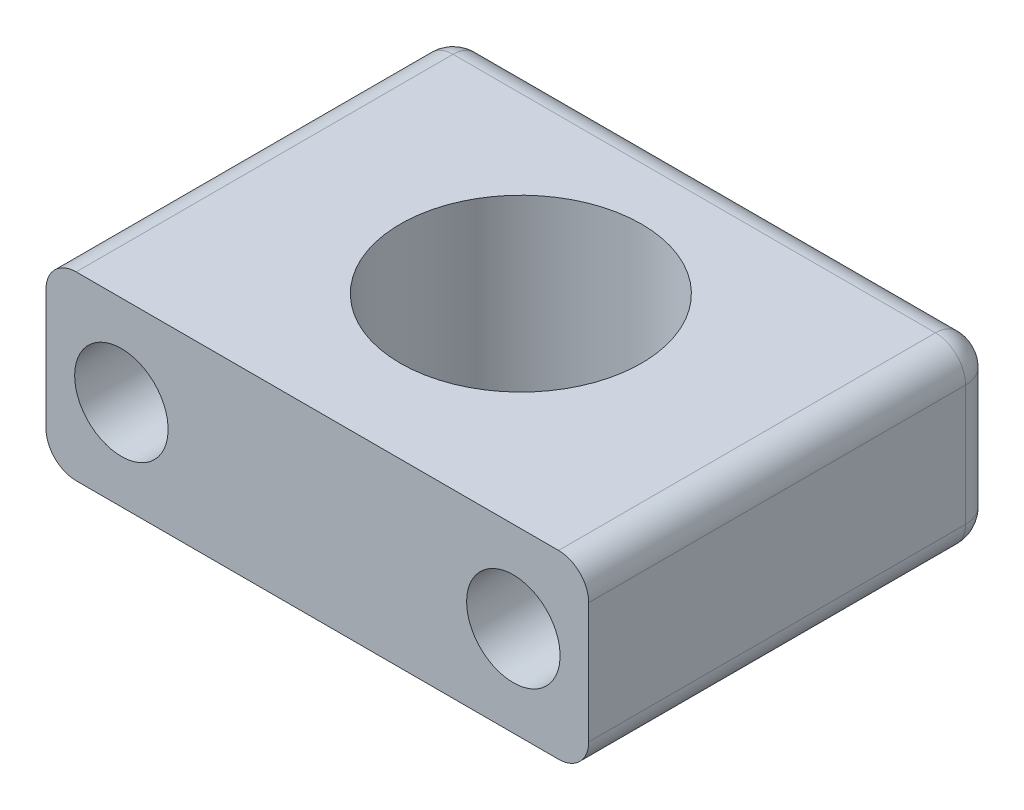
ISO-10303-21;
HEADER;
FILE_DESCRIPTION(('STEP AP214'),'2;1');
FILE_NAME('part.step','',(''),(''),'','','');
FILE_SCHEMA(('AUTOMOTIVE_DESIGN { 1 0 10303 214 1 1 1 1 }'));
ENDSEC;
DATA;
#1=APPLICATION_CONTEXT('core data for automotive mechanical design processes');
#2=APPLICATION_PROTOCOL_DEFINITION('international standard','automotive_design',2000,#1);
#3=PRODUCT_CONTEXT('',#1,'mechanical');
#4=PRODUCT('Part','Part','',(#3));
#5=PRODUCT_RELATED_PRODUCT_CATEGORY('part','',(#4));
#6=PRODUCT_DEFINITION_FORMATION('','',#4);
#7=PRODUCT_DEFINITION_CONTEXT('part definition',#1,'design');
#8=PRODUCT_DEFINITION('design','',#6,#7);
#9=PRODUCT_DEFINITION_SHAPE('','',#8);
#10=(LENGTH_UNIT() NAMED_UNIT(*) SI_UNIT(.MILLI.,.METRE.));
#11=(NAMED_UNIT(*) PLANE_ANGLE_UNIT() SI_UNIT($,.RADIAN.));
#12=(NAMED_UNIT(*) SI_UNIT($,.STERADIAN.) SOLID_ANGLE_UNIT());
#13=UNCERTAINTY_MEASURE_WITH_UNIT(LENGTH_MEASURE(1.E-05),#10,'distance_accuracy_value','');
#14=(GEOMETRIC_REPRESENTATION_CONTEXT(3) GLOBAL_UNCERTAINTY_ASSIGNED_CONTEXT((#13)) GLOBAL_UNIT_ASSIGNED_CONTEXT((#10,
#11,#12)) REPRESENTATION_CONTEXT('',''));
#15=CARTESIAN_POINT('',(0.,0.,0.));
#16=DIRECTION('',(0.,0.,1.));
#17=DIRECTION('',(1.,0.,0.));
#18=AXIS2_PLACEMENT_3D('',#15,#16,#17);
#19=CARTESIAN_POINT('',(0.,12.,0.));
#20=DIRECTION('',(0.,1.,0.));
#21=DIRECTION('',(0.,0.,1.));
#22=AXIS2_PLACEMENT_3D('',#19,#20,#21);
#23=PLANE('',#22);
#24=DIRECTION('',(-1.,0.,0.));
#25=VECTOR('',#24,1.);
#26=CARTESIAN_POINT('',(-18.,12.,-25.));
#27=LINE('',#26,#25);
#28=CARTESIAN_POINT('',(16.,12.,-25.));
#29=VERTEX_POINT('',#28);
#30=CARTESIAN_POINT('',(-16.,12.,-25.));
#31=VERTEX_POINT('',#30);
#32=EDGE_CURVE('E149',#29,#31,#27,.T.);
#33=ORIENTED_EDGE('',*,*,#32,.T.);
#34=DIRECTION('',(0.,0.,1.));
#35=VECTOR('',#34,1.);
#36=CARTESIAN_POINT('',(-16.,12.,0.));
#37=LINE('',#36,#35);
#38=CARTESIAN_POINT('',(-16.,12.,0.));
#39=VERTEX_POINT('',#38);
#40=EDGE_CURVE('E134',#31,#39,#37,.T.);
#41=ORIENTED_EDGE('',*,*,#40,.T.);
#42=DIRECTION('',(1.,0.,0.));
#43=VECTOR('',#42,1.);
#44=CARTESIAN_POINT('',(-18.,12.,0.));
#45=LINE('',#44,#43);
#46=CARTESIAN_POINT('',(16.,12.,0.));
#47=VERTEX_POINT('',#46);
#48=EDGE_CURVE('E146',#39,#47,#45,.T.);
#49=ORIENTED_EDGE('',*,*,#48,.T.);
#50=DIRECTION('',(0.,0.,-1.));
#51=VECTOR('',#50,1.);
#52=CARTESIAN_POINT('',(16.,12.,-27.));
#53=LINE('',#52,#51);
#54=EDGE_CURVE('E152',#47,#29,#53,.T.);
#55=ORIENTED_EDGE('',*,*,#54,.T.);
#56=EDGE_LOOP('',(#33,#41,#49,#55));
#57=FACE_BOUND('',#56,.T.);
#58=CARTESIAN_POINT('',(0.,12.,-13.499999999996));
#59=DIRECTION('',(0.,1.,0.));
#60=DIRECTION('',(0.,0.,1.));
#61=AXIS2_PLACEMENT_3D('',#58,#59,#60);
#62=CIRCLE('',#61,8.);
#63=CARTESIAN_POINT('',(0.,12.,-5.49999999999603));
#64=VERTEX_POINT('',#63);
#65=EDGE_CURVE('E163',#64,#64,#62,.T.);
#66=ORIENTED_EDGE('',*,*,#65,.F.);
#67=EDGE_LOOP('',(#66));
#68=FACE_BOUND('',#67,.T.);
#69=ADVANCED_FACE('F41',(#57,#68),#23,.T.);
#70=CARTESIAN_POINT('',(0.,0.,0.));
#71=DIRECTION('',(0.,1.,0.));
#72=DIRECTION('',(0.,0.,1.));
#73=AXIS2_PLACEMENT_3D('',#70,#71,#72);
#74=PLANE('',#73);
#75=DIRECTION('',(1.,0.,0.));
#76=VECTOR('',#75,1.);
#77=CARTESIAN_POINT('',(-18.,0.,0.));
#78=LINE('',#77,#76);
#79=CARTESIAN_POINT('',(-16.,0.,0.));
#80=VERTEX_POINT('',#79);
#81=CARTESIAN_POINT('',(16.,0.,0.));
#82=VERTEX_POINT('',#81);
#83=EDGE_CURVE('E158',#80,#82,#78,.T.);
#84=ORIENTED_EDGE('',*,*,#83,.F.);
#85=DIRECTION('',(0.,0.,1.));
#86=VECTOR('',#85,1.);
#87=CARTESIAN_POINT('',(-16.,0.,0.));
#88=LINE('',#87,#86);
#89=CARTESIAN_POINT('',(-16.,0.,-25.));
#90=VERTEX_POINT('',#89);
#91=EDGE_CURVE('E184',#80,#90,#88,.F.);
#92=ORIENTED_EDGE('',*,*,#91,.T.);
#93=DIRECTION('',(-1.,0.,0.));
#94=VECTOR('',#93,1.);
#95=CARTESIAN_POINT('',(0.,0.,-25.));
#96=LINE('',#95,#94);
#97=CARTESIAN_POINT('',(16.,0.,-25.));
#98=VERTEX_POINT('',#97);
#99=EDGE_CURVE('E180',#90,#98,#96,.F.);
#100=ORIENTED_EDGE('',*,*,#99,.T.);
#101=DIRECTION('',(0.,0.,-1.));
#102=VECTOR('',#101,1.);
#103=CARTESIAN_POINT('',(16.,0.,0.));
#104=LINE('',#103,#102);
#105=EDGE_CURVE('E182',#98,#82,#104,.F.);
#106=ORIENTED_EDGE('',*,*,#105,.T.);
#107=EDGE_LOOP('',(#84,#92,#100,#106));
#108=FACE_BOUND('',#107,.T.);
#109=CARTESIAN_POINT('',(0.,0.,-13.499999999996));
#110=DIRECTION('',(0.,1.,0.));
#111=DIRECTION('',(0.,0.,1.));
#112=AXIS2_PLACEMENT_3D('',#109,#110,#111);
#113=CIRCLE('',#112,8.);
#114=CARTESIAN_POINT('',(0.,0.,-5.49999999999603));
#115=VERTEX_POINT('',#114);
#116=EDGE_CURVE('E166',#115,#115,#113,.T.);
#117=ORIENTED_EDGE('',*,*,#116,.T.);
#118=EDGE_LOOP('',(#117));
#119=FACE_BOUND('',#118,.T.);
#120=ADVANCED_FACE('F257',(#108,#119),#74,.F.);
#121=CARTESIAN_POINT('',(-18.,12.,-27.));
#122=DIRECTION('',(1.,0.,0.));
#123=DIRECTION('',(0.,0.,-1.));
#124=AXIS2_PLACEMENT_3D('',#121,#122,#123);
#125=PLANE('',#124);
#126=DIRECTION('',(0.,-1.,0.));
#127=VECTOR('',#126,1.);
#128=CARTESIAN_POINT('',(-18.,12.,0.));
#129=LINE('',#128,#127);
#130=CARTESIAN_POINT('',(-18.,10.,0.));
#131=VERTEX_POINT('',#130);
#132=CARTESIAN_POINT('',(-18.,2.,0.));
#133=VERTEX_POINT('',#132);
#134=EDGE_CURVE('E160',#131,#133,#129,.T.);
#135=ORIENTED_EDGE('',*,*,#134,.F.);
#136=DIRECTION('',(0.,0.,1.));
#137=VECTOR('',#136,1.);
#138=CARTESIAN_POINT('',(-18.,10.,-27.));
#139=LINE('',#138,#137);
#140=CARTESIAN_POINT('',(-18.,10.,-25.));
#141=VERTEX_POINT('',#140);
#142=EDGE_CURVE('E135',#131,#141,#139,.F.);
#143=ORIENTED_EDGE('',*,*,#142,.T.);
#144=DIRECTION('',(0.,-1.,0.));
#145=VECTOR('',#144,1.);
#146=CARTESIAN_POINT('',(-18.,12.,-25.));
#147=LINE('',#146,#145);
#148=CARTESIAN_POINT('',(-18.,2.,-25.));
#149=VERTEX_POINT('',#148);
#150=EDGE_CURVE('E140',#141,#149,#147,.T.);
#151=ORIENTED_EDGE('',*,*,#150,.T.);
#152=DIRECTION('',(0.,0.,1.));
#153=VECTOR('',#152,1.);
#154=CARTESIAN_POINT('',(-18.,2.,-27.));
#155=LINE('',#154,#153);
#156=EDGE_CURVE('E177',#149,#133,#155,.T.);
#157=ORIENTED_EDGE('',*,*,#156,.T.);
#158=EDGE_LOOP('',(#135,#143,#151,#157));
#159=FACE_BOUND('',#158,.T.);
#160=ADVANCED_FACE('F261',(#159),#125,.F.);
#161=CARTESIAN_POINT('',(-18.,12.,0.));
#162=DIRECTION('',(0.,0.,-1.));
#163=DIRECTION('',(-1.,0.,0.));
#164=AXIS2_PLACEMENT_3D('',#161,#162,#163);
#165=PLANE('',#164);
#166=CARTESIAN_POINT('',(-13.,6.,0.));
#167=DIRECTION('',(0.,0.,-1.));
#168=DIRECTION('',(-1.,0.,0.));
#169=AXIS2_PLACEMENT_3D('',#166,#167,#168);
#170=CIRCLE('',#169,3.1);
#171=CARTESIAN_POINT('',(-16.1,6.,0.));
#172=VERTEX_POINT('',#171);
#173=EDGE_CURVE('E341',#172,#172,#170,.T.);
#174=ORIENTED_EDGE('',*,*,#173,.T.);
#175=EDGE_LOOP('',(#174));
#176=FACE_BOUND('',#175,.T.);
#177=CARTESIAN_POINT('',(13.,6.,0.));
#178=DIRECTION('',(0.,0.,-1.));
#179=DIRECTION('',(-1.,0.,0.));
#180=AXIS2_PLACEMENT_3D('',#177,#178,#179);
#181=CIRCLE('',#180,3.1);
#182=CARTESIAN_POINT('',(9.9,6.,0.));
#183=VERTEX_POINT('',#182);
#184=EDGE_CURVE('E328',#183,#183,#181,.T.);
#185=ORIENTED_EDGE('',*,*,#184,.T.);
#186=EDGE_LOOP('',(#185));
#187=FACE_BOUND('',#186,.T.);
#188=ORIENTED_EDGE('',*,*,#48,.F.);
#189=CARTESIAN_POINT('',(-16.,10.,0.));
#190=DIRECTION('',(0.,0.,-1.));
#191=DIRECTION('',(-1.,0.,0.));
#192=AXIS2_PLACEMENT_3D('',#189,#190,#191);
#193=CIRCLE('',#192,2.);
#194=EDGE_CURVE('E130',#39,#131,#193,.F.);
#195=ORIENTED_EDGE('',*,*,#194,.T.);
#196=ORIENTED_EDGE('',*,*,#134,.T.);
#197=CARTESIAN_POINT('',(-16.,2.,0.));
#198=DIRECTION('',(0.,0.,-1.));
#199=DIRECTION('',(-1.,0.,0.));
#200=AXIS2_PLACEMENT_3D('',#197,#198,#199);
#201=CIRCLE('',#200,2.);
#202=EDGE_CURVE('E141',#133,#80,#201,.F.);
#203=ORIENTED_EDGE('',*,*,#202,.T.);
#204=ORIENTED_EDGE('',*,*,#83,.T.);
#205=CARTESIAN_POINT('',(16.,2.,0.));
#206=DIRECTION('',(0.,0.,-1.));
#207=DIRECTION('',(-1.,0.,0.));
#208=AXIS2_PLACEMENT_3D('',#205,#206,#207);
#209=CIRCLE('',#208,2.);
#210=CARTESIAN_POINT('',(18.,2.,0.));
#211=VERTEX_POINT('',#210);
#212=EDGE_CURVE('E173',#82,#211,#209,.F.);
#213=ORIENTED_EDGE('',*,*,#212,.T.);
#214=DIRECTION('',(0.,-1.,0.));
#215=VECTOR('',#214,1.);
#216=CARTESIAN_POINT('',(18.,12.,0.));
#217=LINE('',#216,#215);
#218=CARTESIAN_POINT('',(18.,10.,0.));
#219=VERTEX_POINT('',#218);
#220=EDGE_CURVE('E157',#219,#211,#217,.T.);
#221=ORIENTED_EDGE('',*,*,#220,.F.);
#222=CARTESIAN_POINT('',(16.,10.,0.));
#223=DIRECTION('',(0.,0.,-1.));
#224=DIRECTION('',(-1.,0.,0.));
#225=AXIS2_PLACEMENT_3D('',#222,#223,#224);
#226=CIRCLE('',#225,2.);
#227=EDGE_CURVE('E151',#219,#47,#226,.F.);
#228=ORIENTED_EDGE('',*,*,#227,.T.);
#229=EDGE_LOOP('',(#188,#195,#196,#203,#204,#213,#221,#228));
#230=FACE_BOUND('',#229,.T.);
#231=ADVANCED_FACE('F154',(#176,#187,#230),#165,.F.);
#232=CARTESIAN_POINT('',(18.,12.,0.));
#233=DIRECTION('',(-1.,0.,0.));
#234=DIRECTION('',(0.,0.,1.));
#235=AXIS2_PLACEMENT_3D('',#232,#233,#234);
#236=PLANE('',#235);
#237=ORIENTED_EDGE('',*,*,#220,.T.);
#238=DIRECTION('',(0.,0.,-1.));
#239=VECTOR('',#238,1.);
#240=CARTESIAN_POINT('',(18.,2.,0.));
#241=LINE('',#240,#239);
#242=CARTESIAN_POINT('',(18.,2.,-25.));
#243=VERTEX_POINT('',#242);
#244=EDGE_CURVE('E50',#211,#243,#241,.T.);
#245=ORIENTED_EDGE('',*,*,#244,.T.);
#246=DIRECTION('',(0.,-1.,0.));
#247=VECTOR('',#246,1.);
#248=CARTESIAN_POINT('',(18.,12.,-25.));
#249=LINE('',#248,#247);
#250=CARTESIAN_POINT('',(18.,10.,-25.));
#251=VERTEX_POINT('',#250);
#252=EDGE_CURVE('E58',#243,#251,#249,.F.);
#253=ORIENTED_EDGE('',*,*,#252,.T.);
#254=DIRECTION('',(0.,0.,-1.));
#255=VECTOR('',#254,1.);
#256=CARTESIAN_POINT('',(18.,10.,0.));
#257=LINE('',#256,#255);
#258=EDGE_CURVE('E366',#251,#219,#257,.F.);
#259=ORIENTED_EDGE('',*,*,#258,.T.);
#260=EDGE_LOOP('',(#237,#245,#253,#259));
#261=FACE_BOUND('',#260,.T.);
#262=ADVANCED_FACE('F268',(#261),#236,.F.);
#263=CARTESIAN_POINT('',(18.,12.,-27.));
#264=DIRECTION('',(0.,0.,1.));
#265=DIRECTION('',(1.,0.,0.));
#266=AXIS2_PLACEMENT_3D('',#263,#264,#265);
#267=PLANE('',#266);
#268=DIRECTION('',(-1.,0.,0.));
#269=VECTOR('',#268,1.);
#270=CARTESIAN_POINT('',(18.,2.,-27.));
#271=LINE('',#270,#269);
#272=CARTESIAN_POINT('',(16.,2.,-27.));
#273=VERTEX_POINT('',#272);
#274=CARTESIAN_POINT('',(-16.,2.,-27.));
#275=VERTEX_POINT('',#274);
#276=EDGE_CURVE('E192',#273,#275,#271,.T.);
#277=ORIENTED_EDGE('',*,*,#276,.T.);
#278=DIRECTION('',(0.,-1.,0.));
#279=VECTOR('',#278,1.);
#280=CARTESIAN_POINT('',(-16.,12.,-27.));
#281=LINE('',#280,#279);
#282=CARTESIAN_POINT('',(-16.,5.21897503240934,-27.));
#283=VERTEX_POINT('',#282);
#284=EDGE_CURVE('E196',#275,#283,#281,.F.);
#285=ORIENTED_EDGE('',*,*,#284,.T.);
#286=CARTESIAN_POINT('',(-13.,6.,-27.));
#287=DIRECTION('',(0.,0.,-1.));
#288=DIRECTION('',(-1.,0.,0.));
#289=AXIS2_PLACEMENT_3D('',#286,#287,#288);
#290=CIRCLE('',#289,3.1);
#291=CARTESIAN_POINT('',(-16.,6.78102496759066,-27.));
#292=VERTEX_POINT('',#291);
#293=EDGE_CURVE('E334',#292,#283,#290,.T.);
#294=ORIENTED_EDGE('',*,*,#293,.F.);
#295=DIRECTION('',(0.,-1.,0.));
#296=VECTOR('',#295,1.);
#297=CARTESIAN_POINT('',(-16.,12.,-27.));
#298=LINE('',#297,#296);
#299=CARTESIAN_POINT('',(-16.,10.,-27.));
#300=VERTEX_POINT('',#299);
#301=EDGE_CURVE('E190',#292,#300,#298,.F.);
#302=ORIENTED_EDGE('',*,*,#301,.T.);
#303=DIRECTION('',(-1.,0.,0.));
#304=VECTOR('',#303,1.);
#305=CARTESIAN_POINT('',(18.,10.,-27.));
#306=LINE('',#305,#304);
#307=CARTESIAN_POINT('',(16.,10.,-27.));
#308=VERTEX_POINT('',#307);
#309=EDGE_CURVE('E186',#300,#308,#306,.F.);
#310=ORIENTED_EDGE('',*,*,#309,.T.);
#311=DIRECTION('',(0.,-1.,0.));
#312=VECTOR('',#311,1.);
#313=CARTESIAN_POINT('',(16.,12.,-27.));
#314=LINE('',#313,#312);
#315=CARTESIAN_POINT('',(16.,6.78102496759067,-27.));
#316=VERTEX_POINT('',#315);
#317=EDGE_CURVE('E188',#308,#316,#314,.T.);
#318=ORIENTED_EDGE('',*,*,#317,.T.);
#319=CARTESIAN_POINT('',(13.,6.,-27.));
#320=DIRECTION('',(0.,0.,-1.));
#321=DIRECTION('',(-1.,0.,0.));
#322=AXIS2_PLACEMENT_3D('',#319,#320,#321);
#323=CIRCLE('',#322,3.1);
#324=CARTESIAN_POINT('',(16.,5.21897503240933,-27.));
#325=VERTEX_POINT('',#324);
#326=EDGE_CURVE('E326',#325,#316,#323,.T.);
#327=ORIENTED_EDGE('',*,*,#326,.F.);
#328=DIRECTION('',(0.,-1.,0.));
#329=VECTOR('',#328,1.);
#330=CARTESIAN_POINT('',(16.,12.,-27.));
#331=LINE('',#330,#329);
#332=EDGE_CURVE('E194',#325,#273,#331,.T.);
#333=ORIENTED_EDGE('',*,*,#332,.T.);
#334=EDGE_LOOP('',(#277,#285,#294,#302,#310,#318,#327,#333));
#335=FACE_BOUND('',#334,.T.);
#336=ADVANCED_FACE('F265',(#335),#267,.F.);
#337=CARTESIAN_POINT('',(0.,12.,-13.499999999996));
#338=DIRECTION('',(0.,-1.,0.));
#339=DIRECTION('',(0.,0.,-1.));
#340=AXIS2_PLACEMENT_3D('',#337,#338,#339);
#341=CYLINDRICAL_SURFACE('',#340,8.);
#342=ORIENTED_EDGE('',*,*,#65,.T.);
#343=EDGE_LOOP('',(#342));
#344=FACE_BOUND('',#343,.T.);
#345=ORIENTED_EDGE('',*,*,#116,.F.);
#346=EDGE_LOOP('',(#345));
#347=FACE_BOUND('',#346,.T.);
#348=ADVANCED_FACE('F221',(#344,#347),#341,.F.);
#349=CARTESIAN_POINT('',(13.,6.,0.));
#350=DIRECTION('',(0.,0.,-1.));
#351=DIRECTION('',(-1.,0.,0.));
#352=AXIS2_PLACEMENT_3D('',#349,#350,#351);
#353=CYLINDRICAL_SURFACE('',#352,3.1);
#354=ORIENTED_EDGE('',*,*,#184,.F.);
#355=EDGE_LOOP('',(#354));
#356=FACE_BOUND('',#355,.T.);
#357=ORIENTED_EDGE('',*,*,#326,.T.);
#358=CARTESIAN_POINT('',(16.,6.78102496759067,-27.));
#359=CARTESIAN_POINT('',(16.0216044550892,6.6980739852249,-26.999961930451));
#360=CARTESIAN_POINT('',(16.0397514464296,6.61422518322883,-26.9996483322837));
#361=CARTESIAN_POINT('',(16.069047773414,6.44528983989579,-26.9988717380632));
#362=CARTESIAN_POINT('',(16.0801951301015,6.36020295547525,-26.9984086998159));
#363=CARTESIAN_POINT('',(16.0952419186123,6.19114103058589,-26.9977422361716));
#364=CARTESIAN_POINT('',(16.099284721785,6.10717877136919,-26.9975337019571));
#365=CARTESIAN_POINT('',(16.1005415047719,5.93924063073739,-26.9974718652951));
#366=CARTESIAN_POINT('',(16.0977581338626,5.8552647672512,-26.9976184250333));
#367=CARTESIAN_POINT('',(16.0847190615282,5.67884311465359,-26.9982172842747));
#368=CARTESIAN_POINT('',(16.0736961329065,5.58645186822207,-26.9987006022006));
#369=CARTESIAN_POINT('',(16.0508908419709,5.44838626642181,-26.9993663980296));
#370=CARTESIAN_POINT('',(16.0421747822723,5.40218496040595,-26.9995795264727));
#371=CARTESIAN_POINT('',(16.0226513594689,5.31022664632761,-26.9998951354713));
#372=CARTESIAN_POINT('',(16.0118440245958,5.26446963227606,-26.9999976175204));
#373=CARTESIAN_POINT('',(16.,5.21897503240933,-27.));
#374=B_SPLINE_CURVE_WITH_KNOTS('',3,(#358,#359,#360,#361,#362,#363,#364,#365,#366,#367,#368,
#369,#370,#371,#372,#373),.UNSPECIFIED.,.F.,.F.,(4,2,2,2,2,2,2,4),(0.,0.257077765510781,
0.514228180080511,0.766126943074543,1.01792795820987,1.29665537499734,1.43766391378292,
1.57867054912153),.UNSPECIFIED.);
#375=EDGE_CURVE('E11',#316,#325,#374,.T.);
#376=ORIENTED_EDGE('',*,*,#375,.T.);
#377=EDGE_LOOP('',(#357,#376));
#378=FACE_BOUND('',#377,.T.);
#379=ADVANCED_FACE('F216',(#356,#378),#353,.F.);
#380=CARTESIAN_POINT('',(-13.,6.,0.));
#381=DIRECTION('',(0.,0.,-1.));
#382=DIRECTION('',(-1.,0.,0.));
#383=AXIS2_PLACEMENT_3D('',#380,#381,#382);
#384=CYLINDRICAL_SURFACE('',#383,3.1);
#385=ORIENTED_EDGE('',*,*,#173,.F.);
#386=EDGE_LOOP('',(#385));
#387=FACE_BOUND('',#386,.T.);
#388=ORIENTED_EDGE('',*,*,#293,.T.);
#389=CARTESIAN_POINT('',(-16.,5.21897503240934,-27.));
#390=CARTESIAN_POINT('',(-16.0216044550892,5.30192601477511,-26.999961930451));
#391=CARTESIAN_POINT('',(-16.0397514464296,5.38577481677117,-26.9996483322837));
#392=CARTESIAN_POINT('',(-16.0690477734139,5.55471016010421,-26.9988717380632));
#393=CARTESIAN_POINT('',(-16.0801951301015,5.63979704452475,-26.9984086998159));
#394=CARTESIAN_POINT('',(-16.0952419186122,5.80885896941411,-26.9977422361716));
#395=CARTESIAN_POINT('',(-16.099284721785,5.89282122863081,-26.9975337019571));
#396=CARTESIAN_POINT('',(-16.1005415047718,6.06075936926262,-26.9974718652951));
#397=CARTESIAN_POINT('',(-16.0977581338626,6.14473523274881,-26.9976184250333));
#398=CARTESIAN_POINT('',(-16.0847190615282,6.32115688534641,-26.9982172842747));
#399=CARTESIAN_POINT('',(-16.0736961329065,6.41354813177793,-26.9987006022006));
#400=CARTESIAN_POINT('',(-16.0508908419708,6.55161373357818,-26.9993663980296));
#401=CARTESIAN_POINT('',(-16.0421747822723,6.59781503959405,-26.9995795264727));
#402=CARTESIAN_POINT('',(-16.0226513594689,6.68977335367239,-26.9998951354713));
#403=CARTESIAN_POINT('',(-16.0118440245958,6.73553036772393,-26.9999976175204));
#404=CARTESIAN_POINT('',(-16.,6.78102496759066,-27.));
#405=B_SPLINE_CURVE_WITH_KNOTS('',3,(#389,#390,#391,#392,#393,#394,#395,#396,#397,#398,#399,
#400,#401,#402,#403,#404),.UNSPECIFIED.,.F.,.F.,(4,2,2,2,2,2,2,4),(0.,0.25707776551078,
0.514228180080509,0.766126943074541,1.01792795820987,1.29665537499733,1.43766391378291,
1.57867054912151),.UNSPECIFIED.);
#406=EDGE_CURVE('E199',#283,#292,#405,.T.);
#407=ORIENTED_EDGE('',*,*,#406,.T.);
#408=EDGE_LOOP('',(#388,#407));
#409=FACE_BOUND('',#408,.T.);
#410=ADVANCED_FACE('F212',(#387,#409),#384,.F.);
#411=CARTESIAN_POINT('',(16.,2.,0.));
#412=DIRECTION('',(0.,0.,-1.));
#413=DIRECTION('',(-1.,0.,0.));
#414=AXIS2_PLACEMENT_3D('',#411,#412,#413);
#415=CYLINDRICAL_SURFACE('',#414,2.);
#416=CARTESIAN_POINT('',(16.,2.,-25.));
#417=DIRECTION('',(0.,0.,-1.));
#418=DIRECTION('',(-1.,0.,0.));
#419=AXIS2_PLACEMENT_3D('',#416,#417,#418);
#420=CIRCLE('',#419,2.);
#421=EDGE_CURVE('E45',#243,#98,#420,.T.);
#422=ORIENTED_EDGE('',*,*,#421,.F.);
#423=ORIENTED_EDGE('',*,*,#244,.F.);
#424=ORIENTED_EDGE('',*,*,#212,.F.);
#425=ORIENTED_EDGE('',*,*,#105,.F.);
#426=EDGE_LOOP('',(#422,#423,#424,#425));
#427=FACE_BOUND('',#426,.T.);
#428=ADVANCED_FACE('F43',(#427),#415,.T.);
#429=CARTESIAN_POINT('',(16.,2.,-25.));
#430=DIRECTION('',(0.,0.,1.));
#431=DIRECTION('',(1.,0.,0.));
#432=AXIS2_PLACEMENT_3D('',#429,#430,#431);
#433=SPHERICAL_SURFACE('',#432,2.);
#434=CARTESIAN_POINT('',(16.,2.,-25.));
#435=DIRECTION('',(0.,-1.,0.));
#436=DIRECTION('',(0.,0.,-1.));
#437=AXIS2_PLACEMENT_3D('',#434,#435,#436);
#438=CIRCLE('',#437,2.);
#439=EDGE_CURVE('E318',#243,#273,#438,.F.);
#440=ORIENTED_EDGE('',*,*,#439,.F.);
#441=ORIENTED_EDGE('',*,*,#421,.T.);
#442=CARTESIAN_POINT('',(16.,2.,-25.));
#443=DIRECTION('',(1.,0.,0.));
#444=DIRECTION('',(0.,0.,-1.));
#445=AXIS2_PLACEMENT_3D('',#442,#443,#444);
#446=CIRCLE('',#445,2.);
#447=EDGE_CURVE('E320',#273,#98,#446,.F.);
#448=ORIENTED_EDGE('',*,*,#447,.F.);
#449=EDGE_LOOP('',(#440,#441,#448));
#450=FACE_BOUND('',#449,.T.);
#451=ADVANCED_FACE('F247',(#450),#433,.T.);
#452=CARTESIAN_POINT('',(-16.,2.,-27.));
#453=DIRECTION('',(0.,0.,1.));
#454=DIRECTION('',(1.,0.,0.));
#455=AXIS2_PLACEMENT_3D('',#452,#453,#454);
#456=CYLINDRICAL_SURFACE('',#455,2.);
#457=ORIENTED_EDGE('',*,*,#202,.F.);
#458=ORIENTED_EDGE('',*,*,#156,.F.);
#459=CARTESIAN_POINT('',(-16.,2.,-25.));
#460=DIRECTION('',(0.,0.,-1.));
#461=DIRECTION('',(-1.,0.,0.));
#462=AXIS2_PLACEMENT_3D('',#459,#460,#461);
#463=CIRCLE('',#462,2.);
#464=EDGE_CURVE('E315',#90,#149,#463,.T.);
#465=ORIENTED_EDGE('',*,*,#464,.F.);
#466=ORIENTED_EDGE('',*,*,#91,.F.);
#467=EDGE_LOOP('',(#457,#458,#465,#466));
#468=FACE_BOUND('',#467,.T.);
#469=ADVANCED_FACE('F244',(#468),#456,.T.);
#470=CARTESIAN_POINT('',(18.,2.,-25.));
#471=DIRECTION('',(-1.,0.,0.));
#472=DIRECTION('',(0.,0.,1.));
#473=AXIS2_PLACEMENT_3D('',#470,#471,#472);
#474=CYLINDRICAL_SURFACE('',#473,2.);
#475=ORIENTED_EDGE('',*,*,#447,.T.);
#476=ORIENTED_EDGE('',*,*,#99,.F.);
#477=CARTESIAN_POINT('',(-16.,2.,-25.));
#478=DIRECTION('',(-1.,0.,0.));
#479=DIRECTION('',(0.,0.,1.));
#480=AXIS2_PLACEMENT_3D('',#477,#478,#479);
#481=CIRCLE('',#480,2.);
#482=EDGE_CURVE('E312',#275,#90,#481,.T.);
#483=ORIENTED_EDGE('',*,*,#482,.F.);
#484=ORIENTED_EDGE('',*,*,#276,.F.);
#485=EDGE_LOOP('',(#475,#476,#483,#484));
#486=FACE_BOUND('',#485,.T.);
#487=ADVANCED_FACE('F239',(#486),#474,.T.);
#488=CARTESIAN_POINT('',(16.,12.,-25.));
#489=DIRECTION('',(0.,-1.,0.));
#490=DIRECTION('',(0.,0.,-1.));
#491=AXIS2_PLACEMENT_3D('',#488,#489,#490);
#492=CYLINDRICAL_SURFACE('',#491,2.);
#493=ORIENTED_EDGE('',*,*,#375,.F.);
#494=ORIENTED_EDGE('',*,*,#317,.F.);
#495=CARTESIAN_POINT('',(16.,10.,-25.));
#496=DIRECTION('',(0.,1.,0.));
#497=DIRECTION('',(0.,0.,1.));
#498=AXIS2_PLACEMENT_3D('',#495,#496,#497);
#499=CIRCLE('',#498,2.);
#500=EDGE_CURVE('E310',#251,#308,#499,.T.);
#501=ORIENTED_EDGE('',*,*,#500,.F.);
#502=ORIENTED_EDGE('',*,*,#252,.F.);
#503=ORIENTED_EDGE('',*,*,#439,.T.);
#504=ORIENTED_EDGE('',*,*,#332,.F.);
#505=EDGE_LOOP('',(#493,#494,#501,#502,#503,#504));
#506=FACE_BOUND('',#505,.T.);
#507=ADVANCED_FACE('F233',(#506),#492,.T.);
#508=CARTESIAN_POINT('',(16.,10.,0.));
#509=DIRECTION('',(0.,0.,1.));
#510=DIRECTION('',(1.,0.,0.));
#511=AXIS2_PLACEMENT_3D('',#508,#509,#510);
#512=CYLINDRICAL_SURFACE('',#511,2.);
#513=ORIENTED_EDGE('',*,*,#227,.F.);
#514=ORIENTED_EDGE('',*,*,#258,.F.);
#515=CARTESIAN_POINT('',(16.,10.,-25.));
#516=DIRECTION('',(0.,0.,-1.));
#517=DIRECTION('',(-1.,0.,0.));
#518=AXIS2_PLACEMENT_3D('',#515,#516,#517);
#519=CIRCLE('',#518,2.);
#520=EDGE_CURVE('E303',#29,#251,#519,.T.);
#521=ORIENTED_EDGE('',*,*,#520,.F.);
#522=ORIENTED_EDGE('',*,*,#54,.F.);
#523=EDGE_LOOP('',(#513,#514,#521,#522));
#524=FACE_BOUND('',#523,.T.);
#525=ADVANCED_FACE('F238',(#524),#512,.T.);
#526=CARTESIAN_POINT('',(-16.,2.,-25.));
#527=DIRECTION('',(0.,0.,1.));
#528=DIRECTION('',(1.,0.,0.));
#529=AXIS2_PLACEMENT_3D('',#526,#527,#528);
#530=SPHERICAL_SURFACE('',#529,2.);
#531=ORIENTED_EDGE('',*,*,#482,.T.);
#532=ORIENTED_EDGE('',*,*,#464,.T.);
#533=CARTESIAN_POINT('',(-16.,2.,-25.));
#534=DIRECTION('',(0.,-1.,0.));
#535=DIRECTION('',(0.,0.,-1.));
#536=AXIS2_PLACEMENT_3D('',#533,#534,#535);
#537=CIRCLE('',#536,2.);
#538=EDGE_CURVE('E299',#275,#149,#537,.F.);
#539=ORIENTED_EDGE('',*,*,#538,.F.);
#540=EDGE_LOOP('',(#531,#532,#539));
#541=FACE_BOUND('',#540,.T.);
#542=ADVANCED_FACE('F361',(#541),#530,.T.);
#543=CARTESIAN_POINT('',(16.,10.,-25.));
#544=DIRECTION('',(0.,0.,1.));
#545=DIRECTION('',(1.,0.,0.));
#546=AXIS2_PLACEMENT_3D('',#543,#544,#545);
#547=SPHERICAL_SURFACE('',#546,2.);
#548=ORIENTED_EDGE('',*,*,#520,.T.);
#549=ORIENTED_EDGE('',*,*,#500,.T.);
#550=CARTESIAN_POINT('',(16.,10.,-25.));
#551=DIRECTION('',(1.,0.,0.));
#552=DIRECTION('',(0.,0.,-1.));
#553=AXIS2_PLACEMENT_3D('',#550,#551,#552);
#554=CIRCLE('',#553,2.);
#555=EDGE_CURVE('E294',#29,#308,#554,.F.);
#556=ORIENTED_EDGE('',*,*,#555,.F.);
#557=EDGE_LOOP('',(#548,#549,#556));
#558=FACE_BOUND('',#557,.T.);
#559=ADVANCED_FACE('F289',(#558),#547,.T.);
#560=CARTESIAN_POINT('',(-16.,12.,-25.));
#561=DIRECTION('',(0.,-1.,0.));
#562=DIRECTION('',(0.,0.,-1.));
#563=AXIS2_PLACEMENT_3D('',#560,#561,#562);
#564=CYLINDRICAL_SURFACE('',#563,2.);
#565=ORIENTED_EDGE('',*,*,#538,.T.);
#566=ORIENTED_EDGE('',*,*,#150,.F.);
#567=CARTESIAN_POINT('',(-16.,10.,-25.));
#568=DIRECTION('',(0.,1.,0.));
#569=DIRECTION('',(0.,0.,1.));
#570=AXIS2_PLACEMENT_3D('',#567,#568,#569);
#571=CIRCLE('',#570,2.);
#572=EDGE_CURVE('E300',#300,#141,#571,.T.);
#573=ORIENTED_EDGE('',*,*,#572,.F.);
#574=ORIENTED_EDGE('',*,*,#301,.F.);
#575=ORIENTED_EDGE('',*,*,#406,.F.);
#576=ORIENTED_EDGE('',*,*,#284,.F.);
#577=EDGE_LOOP('',(#565,#566,#573,#574,#575,#576));
#578=FACE_BOUND('',#577,.T.);
#579=ADVANCED_FACE('F208',(#578),#564,.T.);
#580=CARTESIAN_POINT('',(0.,10.,-25.));
#581=DIRECTION('',(1.,0.,0.));
#582=DIRECTION('',(0.,0.,-1.));
#583=AXIS2_PLACEMENT_3D('',#580,#581,#582);
#584=CYLINDRICAL_SURFACE('',#583,2.);
#585=ORIENTED_EDGE('',*,*,#555,.T.);
#586=ORIENTED_EDGE('',*,*,#309,.F.);
#587=CARTESIAN_POINT('',(-16.,10.,-25.));
#588=DIRECTION('',(-1.,0.,0.));
#589=DIRECTION('',(0.,0.,1.));
#590=AXIS2_PLACEMENT_3D('',#587,#588,#589);
#591=CIRCLE('',#590,2.);
#592=EDGE_CURVE('E306',#31,#300,#591,.T.);
#593=ORIENTED_EDGE('',*,*,#592,.F.);
#594=ORIENTED_EDGE('',*,*,#32,.F.);
#595=EDGE_LOOP('',(#585,#586,#593,#594));
#596=FACE_BOUND('',#595,.T.);
#597=ADVANCED_FACE('F282',(#596),#584,.T.);
#598=CARTESIAN_POINT('',(-16.,10.,-25.));
#599=DIRECTION('',(0.,0.,1.));
#600=DIRECTION('',(1.,0.,0.));
#601=AXIS2_PLACEMENT_3D('',#598,#599,#600);
#602=SPHERICAL_SURFACE('',#601,2.);
#603=ORIENTED_EDGE('',*,*,#592,.T.);
#604=ORIENTED_EDGE('',*,*,#572,.T.);
#605=CARTESIAN_POINT('',(-16.,10.,-25.));
#606=DIRECTION('',(0.,0.,-1.));
#607=DIRECTION('',(0.,1.,0.));
#608=AXIS2_PLACEMENT_3D('',#605,#606,#607);
#609=CIRCLE('',#608,2.);
#610=EDGE_CURVE('E231',#31,#141,#609,.F.);
#611=ORIENTED_EDGE('',*,*,#610,.F.);
#612=EDGE_LOOP('',(#603,#604,#611));
#613=FACE_BOUND('',#612,.T.);
#614=ADVANCED_FACE('F280',(#613),#602,.T.);
#615=CARTESIAN_POINT('',(-16.,10.,0.));
#616=DIRECTION('',(0.,0.,-1.));
#617=DIRECTION('',(-1.,0.,0.));
#618=AXIS2_PLACEMENT_3D('',#615,#616,#617);
#619=CYLINDRICAL_SURFACE('',#618,2.);
#620=ORIENTED_EDGE('',*,*,#610,.T.);
#621=ORIENTED_EDGE('',*,*,#142,.F.);
#622=ORIENTED_EDGE('',*,*,#194,.F.);
#623=ORIENTED_EDGE('',*,*,#40,.F.);
#624=EDGE_LOOP('',(#620,#621,#622,#623));
#625=FACE_BOUND('',#624,.T.);
#626=ADVANCED_FACE('F133',(#625),#619,.T.);
#627=CLOSED_SHELL('',(#69,#120,#160,#231,#262,#336,#348,#379,#410,#428,#451,#469,#487,#507,#525,
#542,#559,#579,#597,#614,#626));
#628=MANIFOLD_SOLID_BREP('B2',#627);
#629=ADVANCED_BREP_SHAPE_REPRESENTATION('',(#18,#628),#14);
#630=SHAPE_DEFINITION_REPRESENTATION(#9,#629);
ENDSEC;
END-ISO-10303-21;
